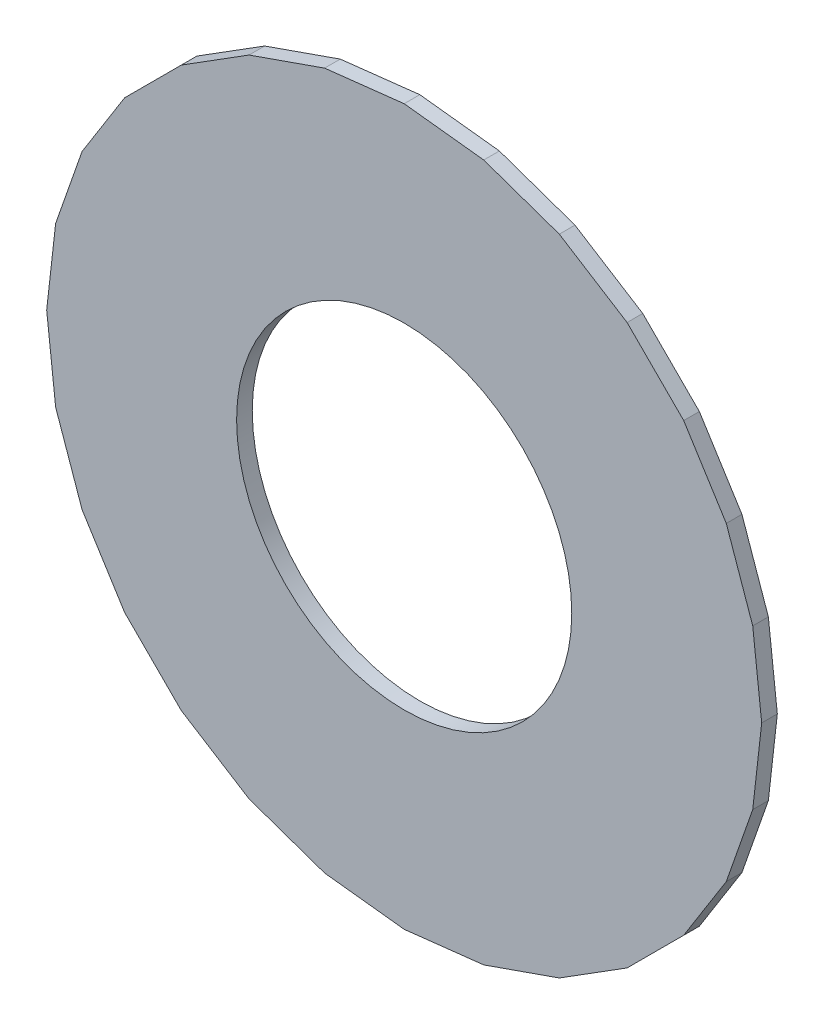
ISO-10303-21;
HEADER;
FILE_DESCRIPTION(('STEP AP214'),'2;1');
FILE_NAME('part.step','',(''),(''),'','','');
FILE_SCHEMA(('AUTOMOTIVE_DESIGN { 1 0 10303 214 1 1 1 1 }'));
ENDSEC;
DATA;
#1=APPLICATION_CONTEXT('core data for automotive mechanical design processes');
#2=APPLICATION_PROTOCOL_DEFINITION('international standard','automotive_design',2000,#1);
#3=PRODUCT_CONTEXT('',#1,'mechanical');
#4=PRODUCT('Part','Part','',(#3));
#5=PRODUCT_RELATED_PRODUCT_CATEGORY('part','',(#4));
#6=PRODUCT_DEFINITION_FORMATION('','',#4);
#7=PRODUCT_DEFINITION_CONTEXT('part definition',#1,'design');
#8=PRODUCT_DEFINITION('design','',#6,#7);
#9=PRODUCT_DEFINITION_SHAPE('','',#8);
#10=(LENGTH_UNIT() NAMED_UNIT(*) SI_UNIT(.MILLI.,.METRE.));
#11=(NAMED_UNIT(*) PLANE_ANGLE_UNIT() SI_UNIT($,.RADIAN.));
#12=(NAMED_UNIT(*) SI_UNIT($,.STERADIAN.) SOLID_ANGLE_UNIT());
#13=UNCERTAINTY_MEASURE_WITH_UNIT(LENGTH_MEASURE(1.E-05),#10,'distance_accuracy_value','');
#14=(GEOMETRIC_REPRESENTATION_CONTEXT(3) GLOBAL_UNCERTAINTY_ASSIGNED_CONTEXT((#13)) GLOBAL_UNIT_ASSIGNED_CONTEXT((#10,
#11,#12)) REPRESENTATION_CONTEXT('',''));
#15=CARTESIAN_POINT('',(0.,0.,0.));
#16=DIRECTION('',(0.,0.,1.));
#17=DIRECTION('',(1.,0.,0.));
#18=AXIS2_PLACEMENT_3D('',#15,#16,#17);
#19=CARTESIAN_POINT('',(170.307,-143.637,-0.045));
#20=DIRECTION('',(0.,0.,-1.));
#21=DIRECTION('',(0.,-1.,0.));
#22=AXIS2_PLACEMENT_3D('',#19,#20,#21);
#23=CYLINDRICAL_SURFACE('',#22,0.375);
#24=CARTESIAN_POINT('',(170.307,-143.637,-0.035));
#25=DIRECTION('',(0.,0.,-1.));
#26=DIRECTION('',(0.,-1.,0.));
#27=AXIS2_PLACEMENT_3D('',#24,#25,#26);
#28=CIRCLE('',#27,0.375);
#29=CARTESIAN_POINT('',(170.307,-144.012,-0.035));
#30=VERTEX_POINT('',#29);
#31=EDGE_CURVE('E372',#30,#30,#28,.T.);
#32=ORIENTED_EDGE('',*,*,#31,.T.);
#33=DIRECTION('',(0.,0.,1.));
#34=VECTOR('',#33,1.);
#35=CARTESIAN_POINT('',(170.307,-144.012,-0.045));
#36=LINE('',#35,#34);
#37=CARTESIAN_POINT('',(170.307,-144.012,0.));
#38=VERTEX_POINT('',#37);
#39=EDGE_CURVE('E11',#30,#38,#36,.T.);
#40=ORIENTED_EDGE('',*,*,#39,.T.);
#41=CARTESIAN_POINT('',(170.307,-143.637,0.));
#42=DIRECTION('',(0.,0.,-1.));
#43=DIRECTION('',(0.,-1.,0.));
#44=AXIS2_PLACEMENT_3D('',#41,#42,#43);
#45=CIRCLE('',#44,0.375);
#46=EDGE_CURVE('E220',#38,#38,#45,.T.);
#47=ORIENTED_EDGE('',*,*,#46,.F.);
#48=ORIENTED_EDGE('',*,*,#39,.F.);
#49=EDGE_LOOP('',(#32,#40,#47,#48));
#50=FACE_BOUND('',#49,.T.);
#51=ADVANCED_FACE('F17',(#50),#23,.F.);
#52=CARTESIAN_POINT('',(170.128983,-144.416942,-0.035));
#53=DIRECTION('',(-0.330278315977027,-0.943883591337077,0.));
#54=DIRECTION('',(-0.943883591337077,0.330278315977027,0.));
#55=AXIS2_PLACEMENT_3D('',#52,#53,#54);
#56=PLANE('',#55);
#57=DIRECTION('',(0.,0.,1.));
#58=VECTOR('',#57,1.);
#59=CARTESIAN_POINT('',(170.128983,-144.416942,-0.035));
#60=LINE('',#59,#58);
#61=CARTESIAN_POINT('',(170.128983,-144.416942,-0.035));
#62=VERTEX_POINT('',#61);
#63=CARTESIAN_POINT('',(170.128983,-144.416942,0.));
#64=VERTEX_POINT('',#63);
#65=EDGE_CURVE('E25',#62,#64,#60,.T.);
#66=ORIENTED_EDGE('',*,*,#65,.T.);
#67=DIRECTION('',(-0.943883591337077,0.330278315977027,0.));
#68=VECTOR('',#67,1.);
#69=CARTESIAN_POINT('',(170.128983,-144.416942,0.));
#70=LINE('',#69,#68);
#71=CARTESIAN_POINT('',(169.959893,-144.357775,0.));
#72=VERTEX_POINT('',#71);
#73=EDGE_CURVE('E317',#64,#72,#70,.T.);
#74=ORIENTED_EDGE('',*,*,#73,.T.);
#75=DIRECTION('',(0.,0.,1.));
#76=VECTOR('',#75,1.);
#77=CARTESIAN_POINT('',(169.959893,-144.357775,-0.035));
#78=LINE('',#77,#76);
#79=CARTESIAN_POINT('',(169.959893,-144.357775,-0.035));
#80=VERTEX_POINT('',#79);
#81=EDGE_CURVE('E254',#80,#72,#78,.T.);
#82=ORIENTED_EDGE('',*,*,#81,.F.);
#83=DIRECTION('',(-0.943883591337077,0.330278315977027,0.));
#84=VECTOR('',#83,1.);
#85=CARTESIAN_POINT('',(170.128983,-144.416942,-0.035));
#86=LINE('',#85,#84);
#87=EDGE_CURVE('E309',#62,#80,#86,.T.);
#88=ORIENTED_EDGE('',*,*,#87,.F.);
#89=EDGE_LOOP('',(#66,#74,#82,#88));
#90=FACE_BOUND('',#89,.T.);
#91=ADVANCED_FACE('F660',(#90),#56,.T.);
#92=CARTESIAN_POINT('',(170.307,-144.437,-0.035));
#93=DIRECTION('',(-0.111966136678988,-0.993712022789894,0.));
#94=DIRECTION('',(-0.993712022789894,0.111966136678988,0.));
#95=AXIS2_PLACEMENT_3D('',#92,#93,#94);
#96=PLANE('',#95);
#97=DIRECTION('',(0.,0.,1.));
#98=VECTOR('',#97,1.);
#99=CARTESIAN_POINT('',(170.307,-144.437,-0.035));
#100=LINE('',#99,#98);
#101=CARTESIAN_POINT('',(170.307,-144.437,-0.035));
#102=VERTEX_POINT('',#101);
#103=CARTESIAN_POINT('',(170.307,-144.437,0.));
#104=VERTEX_POINT('',#103);
#105=EDGE_CURVE('E252',#102,#104,#100,.T.);
#106=ORIENTED_EDGE('',*,*,#105,.T.);
#107=DIRECTION('',(-0.993712022789894,0.111966136678988,0.));
#108=VECTOR('',#107,1.);
#109=CARTESIAN_POINT('',(170.307,-144.437,0.));
#110=LINE('',#109,#108);
#111=EDGE_CURVE('E419',#104,#64,#110,.T.);
#112=ORIENTED_EDGE('',*,*,#111,.T.);
#113=ORIENTED_EDGE('',*,*,#65,.F.);
#114=DIRECTION('',(-0.993712022789894,0.111966136678988,0.));
#115=VECTOR('',#114,1.);
#116=CARTESIAN_POINT('',(170.307,-144.437,-0.035));
#117=LINE('',#116,#115);
#118=EDGE_CURVE('E302',#102,#62,#117,.T.);
#119=ORIENTED_EDGE('',*,*,#118,.F.);
#120=EDGE_LOOP('',(#106,#112,#113,#119));
#121=FACE_BOUND('',#120,.T.);
#122=ADVANCED_FACE('F664',(#121),#96,.T.);
#123=CARTESIAN_POINT('',(169.959893,-144.357775,-0.035));
#124=DIRECTION('',(-0.532032066600227,-0.846724205458361,0.));
#125=DIRECTION('',(-0.846724205458361,0.532032066600227,0.));
#126=AXIS2_PLACEMENT_3D('',#123,#124,#125);
#127=PLANE('',#126);
#128=ORIENTED_EDGE('',*,*,#81,.T.);
#129=DIRECTION('',(-0.846724205458361,0.532032066600227,0.));
#130=VECTOR('',#129,1.);
#131=CARTESIAN_POINT('',(169.959893,-144.357775,0.));
#132=LINE('',#131,#130);
#133=CARTESIAN_POINT('',(169.808208,-144.262465,0.));
#134=VERTEX_POINT('',#133);
#135=EDGE_CURVE('E314',#72,#134,#132,.T.);
#136=ORIENTED_EDGE('',*,*,#135,.T.);
#137=DIRECTION('',(0.,0.,1.));
#138=VECTOR('',#137,1.);
#139=CARTESIAN_POINT('',(169.808208,-144.262465,-0.035));
#140=LINE('',#139,#138);
#141=CARTESIAN_POINT('',(169.808208,-144.262465,-0.035));
#142=VERTEX_POINT('',#141);
#143=EDGE_CURVE('E250',#142,#134,#140,.T.);
#144=ORIENTED_EDGE('',*,*,#143,.F.);
#145=DIRECTION('',(-0.846724205458361,0.532032066600227,0.));
#146=VECTOR('',#145,1.);
#147=CARTESIAN_POINT('',(169.959893,-144.357775,-0.035));
#148=LINE('',#147,#146);
#149=EDGE_CURVE('E313',#80,#142,#148,.T.);
#150=ORIENTED_EDGE('',*,*,#149,.F.);
#151=EDGE_LOOP('',(#128,#136,#144,#150));
#152=FACE_BOUND('',#151,.T.);
#153=ADVANCED_FACE('F662',(#152),#127,.T.);
#154=CARTESIAN_POINT('',(170.485017,-144.416942,-0.035));
#155=DIRECTION('',(0.111966136678988,-0.993712022789894,0.));
#156=DIRECTION('',(0.,0.,-1.));
#157=AXIS2_PLACEMENT_3D('',#154,#155,#156);
#158=PLANE('',#157);
#159=DIRECTION('',(0.,0.,1.));
#160=VECTOR('',#159,1.);
#161=CARTESIAN_POINT('',(170.485017,-144.416942,-0.035));
#162=LINE('',#161,#160);
#163=CARTESIAN_POINT('',(170.485017,-144.416942,-0.035));
#164=VERTEX_POINT('',#163);
#165=CARTESIAN_POINT('',(170.485017,-144.416942,0.));
#166=VERTEX_POINT('',#165);
#167=EDGE_CURVE('E253',#164,#166,#162,.T.);
#168=ORIENTED_EDGE('',*,*,#167,.T.);
#169=DIRECTION('',(-0.993712022789894,-0.111966136678988,0.));
#170=VECTOR('',#169,1.);
#171=CARTESIAN_POINT('',(170.485017,-144.416942,0.));
#172=LINE('',#171,#170);
#173=EDGE_CURVE('E382',#166,#104,#172,.T.);
#174=ORIENTED_EDGE('',*,*,#173,.T.);
#175=ORIENTED_EDGE('',*,*,#105,.F.);
#176=DIRECTION('',(-0.993712022789894,-0.111966136678988,0.));
#177=VECTOR('',#176,1.);
#178=CARTESIAN_POINT('',(170.485017,-144.416942,-0.035));
#179=LINE('',#178,#177);
#180=EDGE_CURVE('E298',#164,#102,#179,.T.);
#181=ORIENTED_EDGE('',*,*,#180,.F.);
#182=EDGE_LOOP('',(#168,#174,#175,#181));
#183=FACE_BOUND('',#182,.T.);
#184=ADVANCED_FACE('F669',(#183),#158,.T.);
#185=CARTESIAN_POINT('',(169.808208,-144.262465,-0.035));
#186=DIRECTION('',(-0.707106781186048,-0.707106781187048,0.));
#187=DIRECTION('',(-0.707106781187048,0.707106781186048,0.));
#188=AXIS2_PLACEMENT_3D('',#185,#186,#187);
#189=PLANE('',#188);
#190=ORIENTED_EDGE('',*,*,#143,.T.);
#191=DIRECTION('',(-0.707106781187048,0.707106781186048,0.));
#192=VECTOR('',#191,1.);
#193=CARTESIAN_POINT('',(169.808208,-144.262465,0.));
#194=LINE('',#193,#192);
#195=CARTESIAN_POINT('',(169.681535,-144.135792,0.));
#196=VERTEX_POINT('',#195);
#197=EDGE_CURVE('E318',#134,#196,#194,.T.);
#198=ORIENTED_EDGE('',*,*,#197,.T.);
#199=DIRECTION('',(0.,0.,1.));
#200=VECTOR('',#199,1.);
#201=CARTESIAN_POINT('',(169.681535,-144.135792,-0.035));
#202=LINE('',#201,#200);
#203=CARTESIAN_POINT('',(169.681535,-144.135792,-0.035));
#204=VERTEX_POINT('',#203);
#205=EDGE_CURVE('E249',#204,#196,#202,.T.);
#206=ORIENTED_EDGE('',*,*,#205,.F.);
#207=DIRECTION('',(-0.707106781187048,0.707106781186048,0.));
#208=VECTOR('',#207,1.);
#209=CARTESIAN_POINT('',(169.808208,-144.262465,-0.035));
#210=LINE('',#209,#208);
#211=EDGE_CURVE('E322',#142,#204,#210,.T.);
#212=ORIENTED_EDGE('',*,*,#211,.F.);
#213=EDGE_LOOP('',(#190,#198,#206,#212));
#214=FACE_BOUND('',#213,.T.);
#215=ADVANCED_FACE('F569',(#214),#189,.T.);
#216=CARTESIAN_POINT('',(170.654107,-144.357775,-0.035));
#217=DIRECTION('',(0.330278315977027,-0.943883591337077,0.));
#218=DIRECTION('',(0.,0.,-1.));
#219=AXIS2_PLACEMENT_3D('',#216,#217,#218);
#220=PLANE('',#219);
#221=DIRECTION('',(0.,0.,1.));
#222=VECTOR('',#221,1.);
#223=CARTESIAN_POINT('',(170.654107,-144.357775,-0.035));
#224=LINE('',#223,#222);
#225=CARTESIAN_POINT('',(170.654107,-144.357775,-0.035));
#226=VERTEX_POINT('',#225);
#227=CARTESIAN_POINT('',(170.654107,-144.357775,0.));
#228=VERTEX_POINT('',#227);
#229=EDGE_CURVE('E246',#226,#228,#224,.T.);
#230=ORIENTED_EDGE('',*,*,#229,.T.);
#231=DIRECTION('',(-0.943883591337077,-0.330278315977027,0.));
#232=VECTOR('',#231,1.);
#233=CARTESIAN_POINT('',(170.654107,-144.357775,0.));
#234=LINE('',#233,#232);
#235=EDGE_CURVE('E342',#228,#166,#234,.T.);
#236=ORIENTED_EDGE('',*,*,#235,.T.);
#237=ORIENTED_EDGE('',*,*,#167,.F.);
#238=DIRECTION('',(-0.943883591337077,-0.330278315977027,0.));
#239=VECTOR('',#238,1.);
#240=CARTESIAN_POINT('',(170.654107,-144.357775,-0.035));
#241=LINE('',#240,#239);
#242=EDGE_CURVE('E294',#226,#164,#241,.T.);
#243=ORIENTED_EDGE('',*,*,#242,.F.);
#244=EDGE_LOOP('',(#230,#236,#237,#243));
#245=FACE_BOUND('',#244,.T.);
#246=ADVANCED_FACE('F672',(#245),#220,.T.);
#247=CARTESIAN_POINT('',(169.681535,-144.135792,-0.035));
#248=DIRECTION('',(-0.846724205458361,-0.532032066600227,0.));
#249=DIRECTION('',(-0.532032066600227,0.846724205458361,0.));
#250=AXIS2_PLACEMENT_3D('',#247,#248,#249);
#251=PLANE('',#250);
#252=ORIENTED_EDGE('',*,*,#205,.T.);
#253=DIRECTION('',(-0.532032066600227,0.846724205458361,0.));
#254=VECTOR('',#253,1.);
#255=CARTESIAN_POINT('',(169.681535,-144.135792,0.));
#256=LINE('',#255,#254);
#257=CARTESIAN_POINT('',(169.586225,-143.984107,0.));
#258=VERTEX_POINT('',#257);
#259=EDGE_CURVE('E404',#196,#258,#256,.T.);
#260=ORIENTED_EDGE('',*,*,#259,.T.);
#261=DIRECTION('',(0.,0.,1.));
#262=VECTOR('',#261,1.);
#263=CARTESIAN_POINT('',(169.586225,-143.984107,-0.035));
#264=LINE('',#263,#262);
#265=CARTESIAN_POINT('',(169.586225,-143.984107,-0.035));
#266=VERTEX_POINT('',#265);
#267=EDGE_CURVE('E242',#266,#258,#264,.T.);
#268=ORIENTED_EDGE('',*,*,#267,.F.);
#269=DIRECTION('',(-0.532032066600227,0.846724205458361,0.));
#270=VECTOR('',#269,1.);
#271=CARTESIAN_POINT('',(169.681535,-144.135792,-0.035));
#272=LINE('',#271,#270);
#273=EDGE_CURVE('E332',#204,#266,#272,.T.);
#274=ORIENTED_EDGE('',*,*,#273,.F.);
#275=EDGE_LOOP('',(#252,#260,#268,#274));
#276=FACE_BOUND('',#275,.T.);
#277=ADVANCED_FACE('F561',(#276),#251,.T.);
#278=CARTESIAN_POINT('',(170.805792,-144.262465,-0.035));
#279=DIRECTION('',(0.532032066600227,-0.846724205458361,0.));
#280=DIRECTION('',(0.,0.,-1.));
#281=AXIS2_PLACEMENT_3D('',#278,#279,#280);
#282=PLANE('',#281);
#283=DIRECTION('',(0.,0.,1.));
#284=VECTOR('',#283,1.);
#285=CARTESIAN_POINT('',(170.805792,-144.262465,-0.035));
#286=LINE('',#285,#284);
#287=CARTESIAN_POINT('',(170.805792,-144.262465,-0.035));
#288=VERTEX_POINT('',#287);
#289=CARTESIAN_POINT('',(170.805792,-144.262465,0.));
#290=VERTEX_POINT('',#289);
#291=EDGE_CURVE('E239',#288,#290,#286,.T.);
#292=ORIENTED_EDGE('',*,*,#291,.T.);
#293=DIRECTION('',(-0.846724205458361,-0.532032066600227,0.));
#294=VECTOR('',#293,1.);
#295=CARTESIAN_POINT('',(170.805792,-144.262465,0.));
#296=LINE('',#295,#294);
#297=EDGE_CURVE('E337',#290,#228,#296,.T.);
#298=ORIENTED_EDGE('',*,*,#297,.T.);
#299=ORIENTED_EDGE('',*,*,#229,.F.);
#300=DIRECTION('',(-0.846724205458361,-0.532032066600227,0.));
#301=VECTOR('',#300,1.);
#302=CARTESIAN_POINT('',(170.805792,-144.262465,-0.035));
#303=LINE('',#302,#301);
#304=EDGE_CURVE('E290',#288,#226,#303,.T.);
#305=ORIENTED_EDGE('',*,*,#304,.F.);
#306=EDGE_LOOP('',(#292,#298,#299,#305));
#307=FACE_BOUND('',#306,.T.);
#308=ADVANCED_FACE('F675',(#307),#282,.T.);
#309=CARTESIAN_POINT('',(169.586225,-143.984107,-0.035));
#310=DIRECTION('',(-0.943883591336766,-0.330278315977918,0.));
#311=DIRECTION('',(-0.330278315977918,0.943883591336766,0.));
#312=AXIS2_PLACEMENT_3D('',#309,#310,#311);
#313=PLANE('',#312);
#314=ORIENTED_EDGE('',*,*,#267,.T.);
#315=DIRECTION('',(-0.330278315977918,0.943883591336766,0.));
#316=VECTOR('',#315,1.);
#317=CARTESIAN_POINT('',(169.586225,-143.984107,0.));
#318=LINE('',#317,#316);
#319=CARTESIAN_POINT('',(169.527058,-143.815017,0.));
#320=VERTEX_POINT('',#319);
#321=EDGE_CURVE('E400',#258,#320,#318,.T.);
#322=ORIENTED_EDGE('',*,*,#321,.T.);
#323=DIRECTION('',(0.,0.,1.));
#324=VECTOR('',#323,1.);
#325=CARTESIAN_POINT('',(169.527058,-143.815017,-0.035));
#326=LINE('',#325,#324);
#327=CARTESIAN_POINT('',(169.527058,-143.815017,-0.035));
#328=VERTEX_POINT('',#327);
#329=EDGE_CURVE('E243',#328,#320,#326,.T.);
#330=ORIENTED_EDGE('',*,*,#329,.F.);
#331=DIRECTION('',(-0.330278315977918,0.943883591336766,0.));
#332=VECTOR('',#331,1.);
#333=CARTESIAN_POINT('',(169.586225,-143.984107,-0.035));
#334=LINE('',#333,#332);
#335=EDGE_CURVE('E336',#266,#328,#334,.T.);
#336=ORIENTED_EDGE('',*,*,#335,.F.);
#337=EDGE_LOOP('',(#314,#322,#330,#336));
#338=FACE_BOUND('',#337,.T.);
#339=ADVANCED_FACE('F575',(#338),#313,.T.);
#340=CARTESIAN_POINT('',(170.932465,-144.135792,-0.035));
#341=DIRECTION('',(0.707106781186048,-0.707106781187048,0.));
#342=DIRECTION('',(0.,0.,-1.));
#343=AXIS2_PLACEMENT_3D('',#340,#341,#342);
#344=PLANE('',#343);
#345=DIRECTION('',(0.,0.,1.));
#346=VECTOR('',#345,1.);
#347=CARTESIAN_POINT('',(170.932465,-144.135792,-0.035));
#348=LINE('',#347,#346);
#349=CARTESIAN_POINT('',(170.932465,-144.135792,-0.035));
#350=VERTEX_POINT('',#349);
#351=CARTESIAN_POINT('',(170.932465,-144.135792,0.));
#352=VERTEX_POINT('',#351);
#353=EDGE_CURVE('E237',#350,#352,#348,.T.);
#354=ORIENTED_EDGE('',*,*,#353,.T.);
#355=DIRECTION('',(-0.707106781187048,-0.707106781186048,0.));
#356=VECTOR('',#355,1.);
#357=CARTESIAN_POINT('',(170.932465,-144.135792,0.));
#358=LINE('',#357,#356);
#359=EDGE_CURVE('E341',#352,#290,#358,.T.);
#360=ORIENTED_EDGE('',*,*,#359,.T.);
#361=ORIENTED_EDGE('',*,*,#291,.F.);
#362=DIRECTION('',(-0.707106781187048,-0.707106781186048,0.));
#363=VECTOR('',#362,1.);
#364=CARTESIAN_POINT('',(170.932465,-144.135792,-0.035));
#365=LINE('',#364,#363);
#366=EDGE_CURVE('E285',#350,#288,#365,.T.);
#367=ORIENTED_EDGE('',*,*,#366,.F.);
#368=EDGE_LOOP('',(#354,#360,#361,#367));
#369=FACE_BOUND('',#368,.T.);
#370=ADVANCED_FACE('F677',(#369),#344,.T.);
#371=CARTESIAN_POINT('',(169.527058,-143.815017,-0.035));
#372=DIRECTION('',(-0.993712022789894,-0.111966136678988,0.));
#373=DIRECTION('',(-0.111966136678988,0.993712022789894,0.));
#374=AXIS2_PLACEMENT_3D('',#371,#372,#373);
#375=PLANE('',#374);
#376=ORIENTED_EDGE('',*,*,#329,.T.);
#377=DIRECTION('',(-0.111966136678988,0.993712022789894,0.));
#378=VECTOR('',#377,1.);
#379=CARTESIAN_POINT('',(169.527058,-143.815017,0.));
#380=LINE('',#379,#378);
#381=CARTESIAN_POINT('',(169.507,-143.637,0.));
#382=VERTEX_POINT('',#381);
#383=EDGE_CURVE('E405',#320,#382,#380,.T.);
#384=ORIENTED_EDGE('',*,*,#383,.T.);
#385=DIRECTION('',(0.,0.,1.));
#386=VECTOR('',#385,1.);
#387=CARTESIAN_POINT('',(169.507,-143.637,-0.035));
#388=LINE('',#387,#386);
#389=CARTESIAN_POINT('',(169.507,-143.637,-0.035));
#390=VERTEX_POINT('',#389);
#391=EDGE_CURVE('E234',#390,#382,#388,.T.);
#392=ORIENTED_EDGE('',*,*,#391,.F.);
#393=DIRECTION('',(-0.111966136678988,0.993712022789894,0.));
#394=VECTOR('',#393,1.);
#395=CARTESIAN_POINT('',(169.527058,-143.815017,-0.035));
#396=LINE('',#395,#394);
#397=EDGE_CURVE('E343',#328,#390,#396,.T.);
#398=ORIENTED_EDGE('',*,*,#397,.F.);
#399=EDGE_LOOP('',(#376,#384,#392,#398));
#400=FACE_BOUND('',#399,.T.);
#401=ADVANCED_FACE('F600',(#400),#375,.T.);
#402=CARTESIAN_POINT('',(171.027775,-143.984107,-0.035));
#403=DIRECTION('',(0.846724205458361,-0.532032066600227,0.));
#404=DIRECTION('',(0.,0.,-1.));
#405=AXIS2_PLACEMENT_3D('',#402,#403,#404);
#406=PLANE('',#405);
#407=DIRECTION('',(0.,0.,1.));
#408=VECTOR('',#407,1.);
#409=CARTESIAN_POINT('',(171.027775,-143.984107,-0.035));
#410=LINE('',#409,#408);
#411=CARTESIAN_POINT('',(171.027775,-143.984107,-0.035));
#412=VERTEX_POINT('',#411);
#413=CARTESIAN_POINT('',(171.027775,-143.984107,0.));
#414=VERTEX_POINT('',#413);
#415=EDGE_CURVE('E238',#412,#414,#410,.T.);
#416=ORIENTED_EDGE('',*,*,#415,.T.);
#417=DIRECTION('',(-0.532032066600227,-0.846724205458361,0.));
#418=VECTOR('',#417,1.);
#419=CARTESIAN_POINT('',(171.027775,-143.984107,0.));
#420=LINE('',#419,#418);
#421=EDGE_CURVE('E422',#414,#352,#420,.T.);
#422=ORIENTED_EDGE('',*,*,#421,.T.);
#423=ORIENTED_EDGE('',*,*,#353,.F.);
#424=DIRECTION('',(-0.532032066600227,-0.846724205458361,0.));
#425=VECTOR('',#424,1.);
#426=CARTESIAN_POINT('',(171.027775,-143.984107,-0.035));
#427=LINE('',#426,#425);
#428=EDGE_CURVE('E281',#412,#350,#427,.T.);
#429=ORIENTED_EDGE('',*,*,#428,.F.);
#430=EDGE_LOOP('',(#416,#422,#423,#429));
#431=FACE_BOUND('',#430,.T.);
#432=ADVANCED_FACE('F448',(#431),#406,.T.);
#433=CARTESIAN_POINT('',(169.507,-143.637,-0.035));
#434=DIRECTION('',(-0.993712022789894,0.111966136678988,0.));
#435=DIRECTION('',(0.,0.,1.));
#436=AXIS2_PLACEMENT_3D('',#433,#434,#435);
#437=PLANE('',#436);
#438=ORIENTED_EDGE('',*,*,#391,.T.);
#439=DIRECTION('',(0.111966136678988,0.993712022789894,0.));
#440=VECTOR('',#439,1.);
#441=CARTESIAN_POINT('',(169.507,-143.637,0.));
#442=LINE('',#441,#440);
#443=CARTESIAN_POINT('',(169.527058,-143.458983,0.));
#444=VERTEX_POINT('',#443);
#445=EDGE_CURVE('E396',#382,#444,#442,.T.);
#446=ORIENTED_EDGE('',*,*,#445,.T.);
#447=DIRECTION('',(0.,0.,1.));
#448=VECTOR('',#447,1.);
#449=CARTESIAN_POINT('',(169.527058,-143.458983,-0.035));
#450=LINE('',#449,#448);
#451=CARTESIAN_POINT('',(169.527058,-143.458983,-0.035));
#452=VERTEX_POINT('',#451);
#453=EDGE_CURVE('E233',#452,#444,#450,.T.);
#454=ORIENTED_EDGE('',*,*,#453,.F.);
#455=DIRECTION('',(0.111966136678988,0.993712022789894,0.));
#456=VECTOR('',#455,1.);
#457=CARTESIAN_POINT('',(169.507,-143.637,-0.035));
#458=LINE('',#457,#456);
#459=EDGE_CURVE('E328',#390,#452,#458,.T.);
#460=ORIENTED_EDGE('',*,*,#459,.F.);
#461=EDGE_LOOP('',(#438,#446,#454,#460));
#462=FACE_BOUND('',#461,.T.);
#463=ADVANCED_FACE('F593',(#462),#437,.T.);
#464=CARTESIAN_POINT('',(171.086942,-143.815017,-0.035));
#465=DIRECTION('',(0.943883591336766,-0.330278315977918,0.));
#466=DIRECTION('',(0.,0.,-1.));
#467=AXIS2_PLACEMENT_3D('',#464,#465,#466);
#468=PLANE('',#467);
#469=DIRECTION('',(0.,0.,1.));
#470=VECTOR('',#469,1.);
#471=CARTESIAN_POINT('',(171.086942,-143.815017,-0.035));
#472=LINE('',#471,#470);
#473=CARTESIAN_POINT('',(171.086942,-143.815017,-0.035));
#474=VERTEX_POINT('',#473);
#475=CARTESIAN_POINT('',(171.086942,-143.815017,0.));
#476=VERTEX_POINT('',#475);
#477=EDGE_CURVE('E229',#474,#476,#472,.T.);
#478=ORIENTED_EDGE('',*,*,#477,.T.);
#479=DIRECTION('',(-0.330278315977918,-0.943883591336766,0.));
#480=VECTOR('',#479,1.);
#481=CARTESIAN_POINT('',(171.086942,-143.815017,0.));
#482=LINE('',#481,#480);
#483=EDGE_CURVE('E213',#476,#414,#482,.T.);
#484=ORIENTED_EDGE('',*,*,#483,.T.);
#485=ORIENTED_EDGE('',*,*,#415,.F.);
#486=DIRECTION('',(-0.330278315977918,-0.943883591336766,0.));
#487=VECTOR('',#486,1.);
#488=CARTESIAN_POINT('',(171.086942,-143.815017,-0.035));
#489=LINE('',#488,#487);
#490=EDGE_CURVE('E286',#474,#412,#489,.T.);
#491=ORIENTED_EDGE('',*,*,#490,.F.);
#492=EDGE_LOOP('',(#478,#484,#485,#491));
#493=FACE_BOUND('',#492,.T.);
#494=ADVANCED_FACE('F439',(#493),#468,.T.);
#495=CARTESIAN_POINT('',(169.527058,-143.458983,-0.035));
#496=DIRECTION('',(-0.943883591336766,0.330278315977918,0.));
#497=DIRECTION('',(0.,0.,1.));
#498=AXIS2_PLACEMENT_3D('',#495,#496,#497);
#499=PLANE('',#498);
#500=ORIENTED_EDGE('',*,*,#453,.T.);
#501=DIRECTION('',(0.330278315977918,0.943883591336766,0.));
#502=VECTOR('',#501,1.);
#503=CARTESIAN_POINT('',(169.527058,-143.458983,0.));
#504=LINE('',#503,#502);
#505=CARTESIAN_POINT('',(169.586225,-143.289893,0.));
#506=VERTEX_POINT('',#505);
#507=EDGE_CURVE('E393',#444,#506,#504,.T.);
#508=ORIENTED_EDGE('',*,*,#507,.T.);
#509=DIRECTION('',(0.,0.,1.));
#510=VECTOR('',#509,1.);
#511=CARTESIAN_POINT('',(169.586225,-143.289893,-0.035));
#512=LINE('',#511,#510);
#513=CARTESIAN_POINT('',(169.586225,-143.289893,-0.035));
#514=VERTEX_POINT('',#513);
#515=EDGE_CURVE('E226',#514,#506,#512,.T.);
#516=ORIENTED_EDGE('',*,*,#515,.F.);
#517=DIRECTION('',(0.330278315977918,0.943883591336766,0.));
#518=VECTOR('',#517,1.);
#519=CARTESIAN_POINT('',(169.527058,-143.458983,-0.035));
#520=LINE('',#519,#518);
#521=EDGE_CURVE('E323',#452,#514,#520,.T.);
#522=ORIENTED_EDGE('',*,*,#521,.F.);
#523=EDGE_LOOP('',(#500,#508,#516,#522));
#524=FACE_BOUND('',#523,.T.);
#525=ADVANCED_FACE('F596',(#524),#499,.T.);
#526=CARTESIAN_POINT('',(171.107,-143.637,-0.035));
#527=DIRECTION('',(0.993712022789894,-0.111966136678988,0.));
#528=DIRECTION('',(0.,0.,-1.));
#529=AXIS2_PLACEMENT_3D('',#526,#527,#528);
#530=PLANE('',#529);
#531=DIRECTION('',(0.,0.,1.));
#532=VECTOR('',#531,1.);
#533=CARTESIAN_POINT('',(171.107,-143.637,-0.035));
#534=LINE('',#533,#532);
#535=CARTESIAN_POINT('',(171.107,-143.637,-0.035));
#536=VERTEX_POINT('',#535);
#537=CARTESIAN_POINT('',(171.107,-143.637,0.));
#538=VERTEX_POINT('',#537);
#539=EDGE_CURVE('E230',#536,#538,#534,.T.);
#540=ORIENTED_EDGE('',*,*,#539,.T.);
#541=DIRECTION('',(-0.111966136678988,-0.993712022789894,0.));
#542=VECTOR('',#541,1.);
#543=CARTESIAN_POINT('',(171.107,-143.637,0.));
#544=LINE('',#543,#542);
#545=EDGE_CURVE('E206',#538,#476,#544,.T.);
#546=ORIENTED_EDGE('',*,*,#545,.T.);
#547=ORIENTED_EDGE('',*,*,#477,.F.);
#548=DIRECTION('',(-0.111966136678988,-0.993712022789894,0.));
#549=VECTOR('',#548,1.);
#550=CARTESIAN_POINT('',(171.107,-143.637,-0.035));
#551=LINE('',#550,#549);
#552=EDGE_CURVE('E477',#536,#474,#551,.T.);
#553=ORIENTED_EDGE('',*,*,#552,.F.);
#554=EDGE_LOOP('',(#540,#546,#547,#553));
#555=FACE_BOUND('',#554,.T.);
#556=ADVANCED_FACE('F715',(#555),#530,.T.);
#557=CARTESIAN_POINT('',(169.586225,-143.289893,-0.035));
#558=DIRECTION('',(-0.846724205458361,0.532032066600227,0.));
#559=DIRECTION('',(0.,0.,1.));
#560=AXIS2_PLACEMENT_3D('',#557,#558,#559);
#561=PLANE('',#560);
#562=ORIENTED_EDGE('',*,*,#515,.T.);
#563=DIRECTION('',(0.532032066600227,0.846724205458361,0.));
#564=VECTOR('',#563,1.);
#565=CARTESIAN_POINT('',(169.586225,-143.289893,0.));
#566=LINE('',#565,#564);
#567=CARTESIAN_POINT('',(169.681535,-143.138208,0.));
#568=VERTEX_POINT('',#567);
#569=EDGE_CURVE('E390',#506,#568,#566,.T.);
#570=ORIENTED_EDGE('',*,*,#569,.T.);
#571=DIRECTION('',(0.,0.,1.));
#572=VECTOR('',#571,1.);
#573=CARTESIAN_POINT('',(169.681535,-143.138208,-0.035));
#574=LINE('',#573,#572);
#575=CARTESIAN_POINT('',(169.681535,-143.138208,-0.035));
#576=VERTEX_POINT('',#575);
#577=EDGE_CURVE('E189',#576,#568,#574,.T.);
#578=ORIENTED_EDGE('',*,*,#577,.F.);
#579=DIRECTION('',(0.532032066600227,0.846724205458361,0.));
#580=VECTOR('',#579,1.);
#581=CARTESIAN_POINT('',(169.586225,-143.289893,-0.035));
#582=LINE('',#581,#580);
#583=EDGE_CURVE('E327',#514,#576,#582,.T.);
#584=ORIENTED_EDGE('',*,*,#583,.F.);
#585=EDGE_LOOP('',(#562,#570,#578,#584));
#586=FACE_BOUND('',#585,.T.);
#587=ADVANCED_FACE('F718',(#586),#561,.T.);
#588=CARTESIAN_POINT('',(171.086942,-143.458983,-0.035));
#589=DIRECTION('',(0.993712022789894,0.111966136678988,0.));
#590=DIRECTION('',(0.,0.,-1.));
#591=AXIS2_PLACEMENT_3D('',#588,#589,#590);
#592=PLANE('',#591);
#593=DIRECTION('',(0.,0.,1.));
#594=VECTOR('',#593,1.);
#595=CARTESIAN_POINT('',(171.086942,-143.458983,-0.035));
#596=LINE('',#595,#594);
#597=CARTESIAN_POINT('',(171.086942,-143.458983,-0.035));
#598=VERTEX_POINT('',#597);
#599=CARTESIAN_POINT('',(171.086942,-143.458983,0.));
#600=VERTEX_POINT('',#599);
#601=EDGE_CURVE('E175',#598,#600,#596,.T.);
#602=ORIENTED_EDGE('',*,*,#601,.T.);
#603=DIRECTION('',(0.111966136678988,-0.993712022789894,0.));
#604=VECTOR('',#603,1.);
#605=CARTESIAN_POINT('',(171.086942,-143.458983,0.));
#606=LINE('',#605,#604);
#607=EDGE_CURVE('E180',#600,#538,#606,.T.);
#608=ORIENTED_EDGE('',*,*,#607,.T.);
#609=ORIENTED_EDGE('',*,*,#539,.F.);
#610=DIRECTION('',(0.111966136678988,-0.993712022789894,0.));
#611=VECTOR('',#610,1.);
#612=CARTESIAN_POINT('',(171.086942,-143.458983,-0.035));
#613=LINE('',#612,#611);
#614=EDGE_CURVE('E184',#598,#536,#613,.T.);
#615=ORIENTED_EDGE('',*,*,#614,.F.);
#616=EDGE_LOOP('',(#602,#608,#609,#615));
#617=FACE_BOUND('',#616,.T.);
#618=ADVANCED_FACE('F177',(#617),#592,.T.);
#619=CARTESIAN_POINT('',(169.681535,-143.138208,-0.035));
#620=DIRECTION('',(-0.707106781186048,0.707106781187048,0.));
#621=DIRECTION('',(0.,0.,1.));
#622=AXIS2_PLACEMENT_3D('',#619,#620,#621);
#623=PLANE('',#622);
#624=ORIENTED_EDGE('',*,*,#577,.T.);
#625=DIRECTION('',(0.707106781187048,0.707106781186048,0.));
#626=VECTOR('',#625,1.);
#627=CARTESIAN_POINT('',(169.681535,-143.138208,0.));
#628=LINE('',#627,#626);
#629=CARTESIAN_POINT('',(169.808208,-143.011535,0.));
#630=VERTEX_POINT('',#629);
#631=EDGE_CURVE('E386',#568,#630,#628,.T.);
#632=ORIENTED_EDGE('',*,*,#631,.T.);
#633=DIRECTION('',(0.,0.,1.));
#634=VECTOR('',#633,1.);
#635=CARTESIAN_POINT('',(169.808208,-143.011535,-0.035));
#636=LINE('',#635,#634);
#637=CARTESIAN_POINT('',(169.808208,-143.011535,-0.035));
#638=VERTEX_POINT('',#637);
#639=EDGE_CURVE('E190',#638,#630,#636,.T.);
#640=ORIENTED_EDGE('',*,*,#639,.F.);
#641=DIRECTION('',(0.707106781187048,0.707106781186048,0.));
#642=VECTOR('',#641,1.);
#643=CARTESIAN_POINT('',(169.681535,-143.138208,-0.035));
#644=LINE('',#643,#642);
#645=EDGE_CURVE('E353',#576,#638,#644,.T.);
#646=ORIENTED_EDGE('',*,*,#645,.F.);
#647=EDGE_LOOP('',(#624,#632,#640,#646));
#648=FACE_BOUND('',#647,.T.);
#649=ADVANCED_FACE('F731',(#648),#623,.T.);
#650=CARTESIAN_POINT('',(171.027775,-143.289893,-0.035));
#651=DIRECTION('',(0.943883591336766,0.330278315977918,0.));
#652=DIRECTION('',(0.,0.,-1.));
#653=AXIS2_PLACEMENT_3D('',#650,#651,#652);
#654=PLANE('',#653);
#655=DIRECTION('',(0.,0.,1.));
#656=VECTOR('',#655,1.);
#657=CARTESIAN_POINT('',(171.027775,-143.289893,-0.035));
#658=LINE('',#657,#656);
#659=CARTESIAN_POINT('',(171.027775,-143.289893,-0.035));
#660=VERTEX_POINT('',#659);
#661=CARTESIAN_POINT('',(171.027775,-143.289893,0.));
#662=VERTEX_POINT('',#661);
#663=EDGE_CURVE('E196',#660,#662,#658,.T.);
#664=ORIENTED_EDGE('',*,*,#663,.T.);
#665=DIRECTION('',(0.330278315977918,-0.943883591336766,0.));
#666=VECTOR('',#665,1.);
#667=CARTESIAN_POINT('',(171.027775,-143.289893,0.));
#668=LINE('',#667,#666);
#669=EDGE_CURVE('E193',#662,#600,#668,.T.);
#670=ORIENTED_EDGE('',*,*,#669,.T.);
#671=ORIENTED_EDGE('',*,*,#601,.F.);
#672=DIRECTION('',(0.330278315977918,-0.943883591336766,0.));
#673=VECTOR('',#672,1.);
#674=CARTESIAN_POINT('',(171.027775,-143.289893,-0.035));
#675=LINE('',#674,#673);
#676=EDGE_CURVE('E489',#660,#598,#675,.T.);
#677=ORIENTED_EDGE('',*,*,#676,.F.);
#678=EDGE_LOOP('',(#664,#670,#671,#677));
#679=FACE_BOUND('',#678,.T.);
#680=ADVANCED_FACE('F194',(#679),#654,.T.);
#681=CARTESIAN_POINT('',(169.808208,-143.011535,-0.035));
#682=DIRECTION('',(-0.532032066600227,0.846724205458361,0.));
#683=DIRECTION('',(0.,0.,1.));
#684=AXIS2_PLACEMENT_3D('',#681,#682,#683);
#685=PLANE('',#684);
#686=ORIENTED_EDGE('',*,*,#639,.T.);
#687=DIRECTION('',(0.846724205458361,0.532032066600227,0.));
#688=VECTOR('',#687,1.);
#689=CARTESIAN_POINT('',(169.808208,-143.011535,0.));
#690=LINE('',#689,#688);
#691=CARTESIAN_POINT('',(169.959893,-142.916225,0.));
#692=VERTEX_POINT('',#691);
#693=EDGE_CURVE('E366',#630,#692,#690,.T.);
#694=ORIENTED_EDGE('',*,*,#693,.T.);
#695=DIRECTION('',(0.,0.,1.));
#696=VECTOR('',#695,1.);
#697=CARTESIAN_POINT('',(169.959893,-142.916225,-0.035));
#698=LINE('',#697,#696);
#699=CARTESIAN_POINT('',(169.959893,-142.916225,-0.035));
#700=VERTEX_POINT('',#699);
#701=EDGE_CURVE('E280',#700,#692,#698,.T.);
#702=ORIENTED_EDGE('',*,*,#701,.F.);
#703=DIRECTION('',(0.846724205458361,0.532032066600227,0.));
#704=VECTOR('',#703,1.);
#705=CARTESIAN_POINT('',(169.808208,-143.011535,-0.035));
#706=LINE('',#705,#704);
#707=EDGE_CURVE('E357',#638,#700,#706,.T.);
#708=ORIENTED_EDGE('',*,*,#707,.F.);
#709=EDGE_LOOP('',(#686,#694,#702,#708));
#710=FACE_BOUND('',#709,.T.);
#711=ADVANCED_FACE('F737',(#710),#685,.T.);
#712=CARTESIAN_POINT('',(170.932465,-143.138208,-0.035));
#713=DIRECTION('',(0.846724205458361,0.532032066600227,0.));
#714=DIRECTION('',(0.,0.,-1.));
#715=AXIS2_PLACEMENT_3D('',#712,#713,#714);
#716=PLANE('',#715);
#717=DIRECTION('',(0.,0.,1.));
#718=VECTOR('',#717,1.);
#719=CARTESIAN_POINT('',(170.932465,-143.138208,-0.035));
#720=LINE('',#719,#718);
#721=CARTESIAN_POINT('',(170.932465,-143.138208,-0.035));
#722=VERTEX_POINT('',#721);
#723=CARTESIAN_POINT('',(170.932465,-143.138208,0.));
#724=VERTEX_POINT('',#723);
#725=EDGE_CURVE('E48',#722,#724,#720,.T.);
#726=ORIENTED_EDGE('',*,*,#725,.T.);
#727=DIRECTION('',(0.532032066600227,-0.846724205458361,0.));
#728=VECTOR('',#727,1.);
#729=CARTESIAN_POINT('',(170.932465,-143.138208,0.));
#730=LINE('',#729,#728);
#731=EDGE_CURVE('E200',#724,#662,#730,.T.);
#732=ORIENTED_EDGE('',*,*,#731,.T.);
#733=ORIENTED_EDGE('',*,*,#663,.F.);
#734=DIRECTION('',(0.532032066600227,-0.846724205458361,0.));
#735=VECTOR('',#734,1.);
#736=CARTESIAN_POINT('',(170.932465,-143.138208,-0.035));
#737=LINE('',#736,#735);
#738=EDGE_CURVE('E463',#722,#660,#737,.T.);
#739=ORIENTED_EDGE('',*,*,#738,.F.);
#740=EDGE_LOOP('',(#726,#732,#733,#739));
#741=FACE_BOUND('',#740,.T.);
#742=ADVANCED_FACE('F726',(#741),#716,.T.);
#743=CARTESIAN_POINT('',(169.959893,-142.916225,-0.035));
#744=DIRECTION('',(-0.330278315977027,0.943883591337077,0.));
#745=DIRECTION('',(0.,0.,1.));
#746=AXIS2_PLACEMENT_3D('',#743,#744,#745);
#747=PLANE('',#746);
#748=ORIENTED_EDGE('',*,*,#701,.T.);
#749=DIRECTION('',(0.943883591337077,0.330278315977027,0.));
#750=VECTOR('',#749,1.);
#751=CARTESIAN_POINT('',(169.959893,-142.916225,0.));
#752=LINE('',#751,#750);
#753=CARTESIAN_POINT('',(170.128983,-142.857058,0.));
#754=VERTEX_POINT('',#753);
#755=EDGE_CURVE('E362',#692,#754,#752,.T.);
#756=ORIENTED_EDGE('',*,*,#755,.T.);
#757=DIRECTION('',(0.,0.,1.));
#758=VECTOR('',#757,1.);
#759=CARTESIAN_POINT('',(170.128983,-142.857058,-0.035));
#760=LINE('',#759,#758);
#761=CARTESIAN_POINT('',(170.128983,-142.857058,-0.035));
#762=VERTEX_POINT('',#761);
#763=EDGE_CURVE('E217',#762,#754,#760,.T.);
#764=ORIENTED_EDGE('',*,*,#763,.F.);
#765=DIRECTION('',(0.943883591337077,0.330278315977027,0.));
#766=VECTOR('',#765,1.);
#767=CARTESIAN_POINT('',(169.959893,-142.916225,-0.035));
#768=LINE('',#767,#766);
#769=EDGE_CURVE('E361',#700,#762,#768,.T.);
#770=ORIENTED_EDGE('',*,*,#769,.F.);
#771=EDGE_LOOP('',(#748,#756,#764,#770));
#772=FACE_BOUND('',#771,.T.);
#773=ADVANCED_FACE('F722',(#772),#747,.T.);
#774=CARTESIAN_POINT('',(170.805792,-143.011535,-0.035));
#775=DIRECTION('',(0.707106781186048,0.707106781187048,0.));
#776=DIRECTION('',(0.,0.,-1.));
#777=AXIS2_PLACEMENT_3D('',#774,#775,#776);
#778=PLANE('',#777);
#779=DIRECTION('',(0.,0.,1.));
#780=VECTOR('',#779,1.);
#781=CARTESIAN_POINT('',(170.805792,-143.011535,-0.035));
#782=LINE('',#781,#780);
#783=CARTESIAN_POINT('',(170.805792,-143.011535,-0.035));
#784=VERTEX_POINT('',#783);
#785=CARTESIAN_POINT('',(170.805792,-143.011535,0.));
#786=VERTEX_POINT('',#785);
#787=EDGE_CURVE('E473',#784,#786,#782,.T.);
#788=ORIENTED_EDGE('',*,*,#787,.T.);
#789=DIRECTION('',(0.707106781187048,-0.707106781186048,0.));
#790=VECTOR('',#789,1.);
#791=CARTESIAN_POINT('',(170.805792,-143.011535,0.));
#792=LINE('',#791,#790);
#793=EDGE_CURVE('E223',#786,#724,#792,.T.);
#794=ORIENTED_EDGE('',*,*,#793,.T.);
#795=ORIENTED_EDGE('',*,*,#725,.F.);
#796=DIRECTION('',(0.707106781187048,-0.707106781186048,0.));
#797=VECTOR('',#796,1.);
#798=CARTESIAN_POINT('',(170.805792,-143.011535,-0.035));
#799=LINE('',#798,#797);
#800=EDGE_CURVE('E459',#784,#722,#799,.T.);
#801=ORIENTED_EDGE('',*,*,#800,.F.);
#802=EDGE_LOOP('',(#788,#794,#795,#801));
#803=FACE_BOUND('',#802,.T.);
#804=ADVANCED_FACE('F712',(#803),#778,.T.);
#805=CARTESIAN_POINT('',(170.128983,-142.857058,-0.035));
#806=DIRECTION('',(-0.111966136678988,0.993712022789894,0.));
#807=DIRECTION('',(0.,0.,1.));
#808=AXIS2_PLACEMENT_3D('',#805,#806,#807);
#809=PLANE('',#808);
#810=ORIENTED_EDGE('',*,*,#763,.T.);
#811=DIRECTION('',(0.993712022789894,0.111966136678988,0.));
#812=VECTOR('',#811,1.);
#813=CARTESIAN_POINT('',(170.128983,-142.857058,0.));
#814=LINE('',#813,#812);
#815=CARTESIAN_POINT('',(170.307,-142.837,0.));
#816=VERTEX_POINT('',#815);
#817=EDGE_CURVE('E367',#754,#816,#814,.T.);
#818=ORIENTED_EDGE('',*,*,#817,.T.);
#819=DIRECTION('',(0.,0.,1.));
#820=VECTOR('',#819,1.);
#821=CARTESIAN_POINT('',(170.307,-142.837,-0.035));
#822=LINE('',#821,#820);
#823=CARTESIAN_POINT('',(170.307,-142.837,-0.035));
#824=VERTEX_POINT('',#823);
#825=EDGE_CURVE('E493',#824,#816,#822,.T.);
#826=ORIENTED_EDGE('',*,*,#825,.F.);
#827=DIRECTION('',(0.993712022789894,0.111966136678988,0.));
#828=VECTOR('',#827,1.);
#829=CARTESIAN_POINT('',(170.128983,-142.857058,-0.035));
#830=LINE('',#829,#828);
#831=EDGE_CURVE('E371',#762,#824,#830,.T.);
#832=ORIENTED_EDGE('',*,*,#831,.F.);
#833=EDGE_LOOP('',(#810,#818,#826,#832));
#834=FACE_BOUND('',#833,.T.);
#835=ADVANCED_FACE('F707',(#834),#809,.T.);
#836=CARTESIAN_POINT('',(0.,0.,0.));
#837=DIRECTION('',(0.,0.,1.));
#838=DIRECTION('',(1.,0.,0.));
#839=AXIS2_PLACEMENT_3D('',#836,#837,#838);
#840=PLANE('',#839);
#841=ORIENTED_EDGE('',*,*,#46,.T.);
#842=EDGE_LOOP('',(#841));
#843=FACE_BOUND('',#842,.T.);
#844=DIRECTION('',(0.943883591337077,-0.330278315977027,0.));
#845=VECTOR('',#844,1.);
#846=CARTESIAN_POINT('',(170.485017,-142.857058,0.));
#847=LINE('',#846,#845);
#848=CARTESIAN_POINT('',(170.485017,-142.857058,0.));
#849=VERTEX_POINT('',#848);
#850=CARTESIAN_POINT('',(170.654107,-142.916225,0.));
#851=VERTEX_POINT('',#850);
#852=EDGE_CURVE('E524',#849,#851,#847,.T.);
#853=ORIENTED_EDGE('',*,*,#852,.F.);
#854=DIRECTION('',(0.993712022789894,-0.111966136678988,0.));
#855=VECTOR('',#854,1.);
#856=CARTESIAN_POINT('',(170.307,-142.837,0.));
#857=LINE('',#856,#855);
#858=EDGE_CURVE('E469',#816,#849,#857,.T.);
#859=ORIENTED_EDGE('',*,*,#858,.F.);
#860=ORIENTED_EDGE('',*,*,#817,.F.);
#861=ORIENTED_EDGE('',*,*,#755,.F.);
#862=ORIENTED_EDGE('',*,*,#693,.F.);
#863=ORIENTED_EDGE('',*,*,#631,.F.);
#864=ORIENTED_EDGE('',*,*,#569,.F.);
#865=ORIENTED_EDGE('',*,*,#507,.F.);
#866=ORIENTED_EDGE('',*,*,#445,.F.);
#867=ORIENTED_EDGE('',*,*,#383,.F.);
#868=ORIENTED_EDGE('',*,*,#321,.F.);
#869=ORIENTED_EDGE('',*,*,#259,.F.);
#870=ORIENTED_EDGE('',*,*,#197,.F.);
#871=ORIENTED_EDGE('',*,*,#135,.F.);
#872=ORIENTED_EDGE('',*,*,#73,.F.);
#873=ORIENTED_EDGE('',*,*,#111,.F.);
#874=ORIENTED_EDGE('',*,*,#173,.F.);
#875=ORIENTED_EDGE('',*,*,#235,.F.);
#876=ORIENTED_EDGE('',*,*,#297,.F.);
#877=ORIENTED_EDGE('',*,*,#359,.F.);
#878=ORIENTED_EDGE('',*,*,#421,.F.);
#879=ORIENTED_EDGE('',*,*,#483,.F.);
#880=ORIENTED_EDGE('',*,*,#545,.F.);
#881=ORIENTED_EDGE('',*,*,#607,.F.);
#882=ORIENTED_EDGE('',*,*,#669,.F.);
#883=ORIENTED_EDGE('',*,*,#731,.F.);
#884=ORIENTED_EDGE('',*,*,#793,.F.);
#885=DIRECTION('',(0.846724205458361,-0.532032066600227,0.));
#886=VECTOR('',#885,1.);
#887=CARTESIAN_POINT('',(170.654107,-142.916225,0.));
#888=LINE('',#887,#886);
#889=EDGE_CURVE('E468',#851,#786,#888,.T.);
#890=ORIENTED_EDGE('',*,*,#889,.F.);
#891=EDGE_LOOP('',(#853,#859,#860,#861,#862,#863,#864,#865,#866,#867,#868,#869,#870,#871,#872,
#873,#874,#875,#876,#877,#878,#879,#880,#881,#882,#883,#884,#890));
#892=FACE_BOUND('',#891,.T.);
#893=ADVANCED_FACE('F203',(#843,#892),#840,.T.);
#894=CARTESIAN_POINT('',(0.,0.,-0.035));
#895=DIRECTION('',(0.,0.,1.));
#896=DIRECTION('',(1.,0.,0.));
#897=AXIS2_PLACEMENT_3D('',#894,#895,#896);
#898=PLANE('',#897);
#899=ORIENTED_EDGE('',*,*,#31,.F.);
#900=EDGE_LOOP('',(#899));
#901=FACE_BOUND('',#900,.T.);
#902=DIRECTION('',(0.846724205458361,-0.532032066600227,0.));
#903=VECTOR('',#902,1.);
#904=CARTESIAN_POINT('',(170.654107,-142.916225,-0.035));
#905=LINE('',#904,#903);
#906=CARTESIAN_POINT('',(170.654107,-142.916225,-0.035));
#907=VERTEX_POINT('',#906);
#908=EDGE_CURVE('E276',#907,#784,#905,.T.);
#909=ORIENTED_EDGE('',*,*,#908,.T.);
#910=ORIENTED_EDGE('',*,*,#800,.T.);
#911=ORIENTED_EDGE('',*,*,#738,.T.);
#912=ORIENTED_EDGE('',*,*,#676,.T.);
#913=ORIENTED_EDGE('',*,*,#614,.T.);
#914=ORIENTED_EDGE('',*,*,#552,.T.);
#915=ORIENTED_EDGE('',*,*,#490,.T.);
#916=ORIENTED_EDGE('',*,*,#428,.T.);
#917=ORIENTED_EDGE('',*,*,#366,.T.);
#918=ORIENTED_EDGE('',*,*,#304,.T.);
#919=ORIENTED_EDGE('',*,*,#242,.T.);
#920=ORIENTED_EDGE('',*,*,#180,.T.);
#921=ORIENTED_EDGE('',*,*,#118,.T.);
#922=ORIENTED_EDGE('',*,*,#87,.T.);
#923=ORIENTED_EDGE('',*,*,#149,.T.);
#924=ORIENTED_EDGE('',*,*,#211,.T.);
#925=ORIENTED_EDGE('',*,*,#273,.T.);
#926=ORIENTED_EDGE('',*,*,#335,.T.);
#927=ORIENTED_EDGE('',*,*,#397,.T.);
#928=ORIENTED_EDGE('',*,*,#459,.T.);
#929=ORIENTED_EDGE('',*,*,#521,.T.);
#930=ORIENTED_EDGE('',*,*,#583,.T.);
#931=ORIENTED_EDGE('',*,*,#645,.T.);
#932=ORIENTED_EDGE('',*,*,#707,.T.);
#933=ORIENTED_EDGE('',*,*,#769,.T.);
#934=ORIENTED_EDGE('',*,*,#831,.T.);
#935=DIRECTION('',(0.993712022789894,-0.111966136678988,0.));
#936=VECTOR('',#935,1.);
#937=CARTESIAN_POINT('',(170.307,-142.837,-0.035));
#938=LINE('',#937,#936);
#939=CARTESIAN_POINT('',(170.485017,-142.857058,-0.035));
#940=VERTEX_POINT('',#939);
#941=EDGE_CURVE('E464',#824,#940,#938,.T.);
#942=ORIENTED_EDGE('',*,*,#941,.T.);
#943=DIRECTION('',(0.943883591337077,-0.330278315977027,0.));
#944=VECTOR('',#943,1.);
#945=CARTESIAN_POINT('',(170.485017,-142.857058,-0.035));
#946=LINE('',#945,#944);
#947=EDGE_CURVE('E507',#940,#907,#946,.T.);
#948=ORIENTED_EDGE('',*,*,#947,.T.);
#949=EDGE_LOOP('',(#909,#910,#911,#912,#913,#914,#915,#916,#917,#918,#919,#920,#921,#922,#923,
#924,#925,#926,#927,#928,#929,#930,#931,#932,#933,#934,#942,#948));
#950=FACE_BOUND('',#949,.T.);
#951=ADVANCED_FACE('F598',(#901,#950),#898,.F.);
#952=CARTESIAN_POINT('',(170.654107,-142.916225,-0.035));
#953=DIRECTION('',(0.532032066600227,0.846724205458361,0.));
#954=DIRECTION('',(0.,0.,-1.));
#955=AXIS2_PLACEMENT_3D('',#952,#953,#954);
#956=PLANE('',#955);
#957=DIRECTION('',(0.,0.,1.));
#958=VECTOR('',#957,1.);
#959=CARTESIAN_POINT('',(170.654107,-142.916225,-0.035));
#960=LINE('',#959,#958);
#961=EDGE_CURVE('E515',#907,#851,#960,.T.);
#962=ORIENTED_EDGE('',*,*,#961,.T.);
#963=ORIENTED_EDGE('',*,*,#889,.T.);
#964=ORIENTED_EDGE('',*,*,#787,.F.);
#965=ORIENTED_EDGE('',*,*,#908,.F.);
#966=EDGE_LOOP('',(#962,#963,#964,#965));
#967=FACE_BOUND('',#966,.T.);
#968=ADVANCED_FACE('F697',(#967),#956,.T.);
#969=CARTESIAN_POINT('',(170.307,-142.837,-0.035));
#970=DIRECTION('',(0.111966136678988,0.993712022789894,0.));
#971=DIRECTION('',(0.,0.,-1.));
#972=AXIS2_PLACEMENT_3D('',#969,#970,#971);
#973=PLANE('',#972);
#974=ORIENTED_EDGE('',*,*,#825,.T.);
#975=ORIENTED_EDGE('',*,*,#858,.T.);
#976=DIRECTION('',(0.,0.,1.));
#977=VECTOR('',#976,1.);
#978=CARTESIAN_POINT('',(170.485017,-142.857058,-0.035));
#979=LINE('',#978,#977);
#980=EDGE_CURVE('E544',#940,#849,#979,.T.);
#981=ORIENTED_EDGE('',*,*,#980,.F.);
#982=ORIENTED_EDGE('',*,*,#941,.F.);
#983=EDGE_LOOP('',(#974,#975,#981,#982));
#984=FACE_BOUND('',#983,.T.);
#985=ADVANCED_FACE('F704',(#984),#973,.T.);
#986=CARTESIAN_POINT('',(170.485017,-142.857058,-0.035));
#987=DIRECTION('',(0.330278315977027,0.943883591337077,0.));
#988=DIRECTION('',(0.,0.,-1.));
#989=AXIS2_PLACEMENT_3D('',#986,#987,#988);
#990=PLANE('',#989);
#991=ORIENTED_EDGE('',*,*,#980,.T.);
#992=ORIENTED_EDGE('',*,*,#852,.T.);
#993=ORIENTED_EDGE('',*,*,#961,.F.);
#994=ORIENTED_EDGE('',*,*,#947,.F.);
#995=EDGE_LOOP('',(#991,#992,#993,#994));
#996=FACE_BOUND('',#995,.T.);
#997=ADVANCED_FACE('F952',(#996),#990,.T.);
#998=CLOSED_SHELL('',(#51,#91,#122,#153,#184,#215,#246,#277,#308,#339,#370,#401,#432,#463,#494,
#525,#556,#587,#618,#649,#680,#711,#742,#773,#804,#835,#893,#951,#968,#985,#997));
#999=MANIFOLD_SOLID_BREP('B1',#998);
#1000=ADVANCED_BREP_SHAPE_REPRESENTATION('',(#18,#999),#14);
#1001=SHAPE_DEFINITION_REPRESENTATION(#9,#1000);
ENDSEC;
END-ISO-10303-21;
